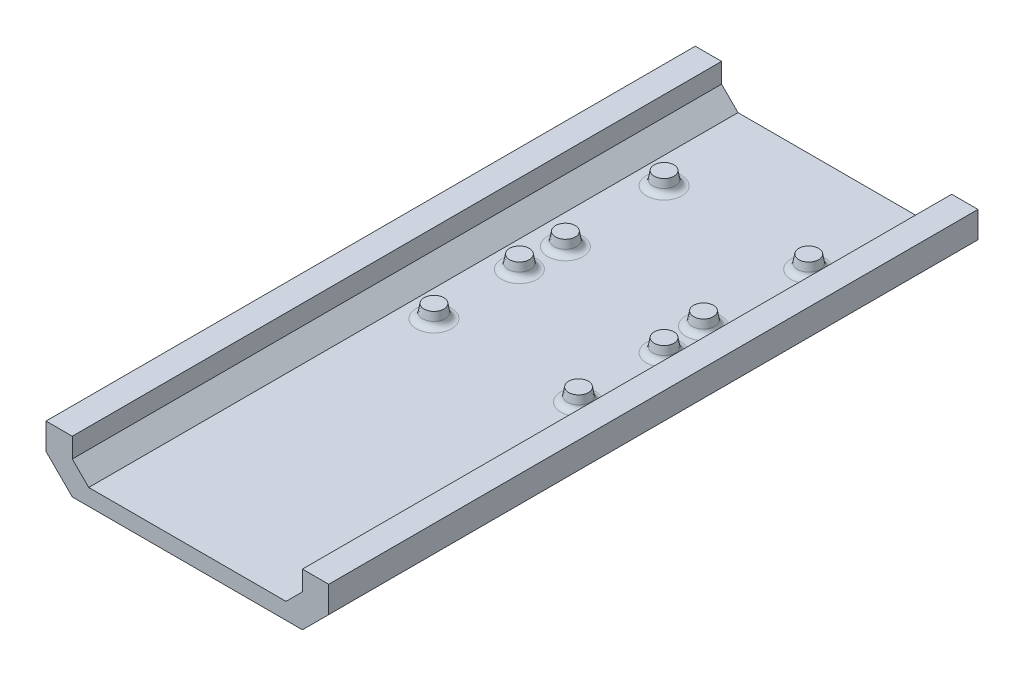
ISO-10303-21;
HEADER;
FILE_DESCRIPTION(('STEP AP214'),'2;1');
FILE_NAME('part.step','',(''),(''),'','','');
FILE_SCHEMA(('AUTOMOTIVE_DESIGN { 1 0 10303 214 1 1 1 1 }'));
ENDSEC;
DATA;
#1=APPLICATION_CONTEXT('core data for automotive mechanical design processes');
#2=APPLICATION_PROTOCOL_DEFINITION('international standard','automotive_design',2000,#1);
#3=PRODUCT_CONTEXT('',#1,'mechanical');
#4=PRODUCT('Part','Part','',(#3));
#5=PRODUCT_RELATED_PRODUCT_CATEGORY('part','',(#4));
#6=PRODUCT_DEFINITION_FORMATION('','',#4);
#7=PRODUCT_DEFINITION_CONTEXT('part definition',#1,'design');
#8=PRODUCT_DEFINITION('design','',#6,#7);
#9=PRODUCT_DEFINITION_SHAPE('','',#8);
#10=(LENGTH_UNIT() NAMED_UNIT(*) SI_UNIT(.MILLI.,.METRE.));
#11=(NAMED_UNIT(*) PLANE_ANGLE_UNIT() SI_UNIT($,.RADIAN.));
#12=(NAMED_UNIT(*) SI_UNIT($,.STERADIAN.) SOLID_ANGLE_UNIT());
#13=UNCERTAINTY_MEASURE_WITH_UNIT(LENGTH_MEASURE(1.E-05),#10,'distance_accuracy_value','');
#14=(GEOMETRIC_REPRESENTATION_CONTEXT(3) GLOBAL_UNCERTAINTY_ASSIGNED_CONTEXT((#13)) GLOBAL_UNIT_ASSIGNED_CONTEXT((#10,
#11,#12)) REPRESENTATION_CONTEXT('',''));
#15=CARTESIAN_POINT('',(0.,0.,0.));
#16=DIRECTION('',(0.,0.,1.));
#17=DIRECTION('',(1.,0.,0.));
#18=AXIS2_PLACEMENT_3D('',#15,#16,#17);
#19=CARTESIAN_POINT('',(-46.0896565672747,-6.55484336424991,-59.4379338238223));
#20=DIRECTION('',(0.,-1.,0.));
#21=DIRECTION('',(0.,0.,-1.));
#22=AXIS2_PLACEMENT_3D('',#19,#20,#21);
#23=CONICAL_SURFACE('',#22,3.81,0.174532925199433);
#24=CARTESIAN_POINT('',(-46.0896565672747,-9.53590973552391,-59.4379338238223));
#25=DIRECTION('',(0.,-1.,0.));
#26=DIRECTION('',(0.,0.,-1.));
#27=AXIS2_PLACEMENT_3D('',#24,#25,#26);
#28=CIRCLE('',#27,4.33564243253829);
#29=CARTESIAN_POINT('',(-46.0896565672747,-9.53590973552391,-63.7735762563605));
#30=VERTEX_POINT('',#29);
#31=EDGE_CURVE('E314',#30,#30,#28,.F.);
#32=ORIENTED_EDGE('',*,*,#31,.T.);
#33=EDGE_LOOP('',(#32));
#34=FACE_BOUND('',#33,.T.);
#35=CARTESIAN_POINT('',(-46.0896565672747,-6.55484336424991,-59.4379338238223));
#36=DIRECTION('',(0.,-1.,0.));
#37=DIRECTION('',(0.,0.,-1.));
#38=AXIS2_PLACEMENT_3D('',#35,#36,#37);
#39=CIRCLE('',#38,3.81);
#40=CARTESIAN_POINT('',(-46.0896565672747,-6.55484336424991,-63.2479338238223));
#41=VERTEX_POINT('',#40);
#42=EDGE_CURVE('E278',#41,#41,#39,.T.);
#43=ORIENTED_EDGE('',*,*,#42,.T.);
#44=EDGE_LOOP('',(#43));
#45=FACE_BOUND('',#44,.T.);
#46=ADVANCED_FACE('F40',(#34,#45),#23,.T.);
#47=CARTESIAN_POINT('',(-46.0896565672747,-6.55484336424991,-3.55793382382226));
#48=DIRECTION('',(0.,-1.,0.));
#49=DIRECTION('',(0.,0.,-1.));
#50=AXIS2_PLACEMENT_3D('',#47,#48,#49);
#51=CONICAL_SURFACE('',#50,3.81,0.174532925199433);
#52=CARTESIAN_POINT('',(-46.0896565672747,-9.53590973552391,-3.55793382382226));
#53=DIRECTION('',(0.,-1.,0.));
#54=DIRECTION('',(0.,0.,-1.));
#55=AXIS2_PLACEMENT_3D('',#52,#53,#54);
#56=CIRCLE('',#55,4.33564243253829);
#57=CARTESIAN_POINT('',(-46.0896565672747,-9.53590973552391,-7.89357625636054));
#58=VERTEX_POINT('',#57);
#59=EDGE_CURVE('E322',#58,#58,#56,.F.);
#60=ORIENTED_EDGE('',*,*,#59,.T.);
#61=EDGE_LOOP('',(#60));
#62=FACE_BOUND('',#61,.T.);
#63=CARTESIAN_POINT('',(-46.0896565672747,-6.55484336424991,-3.55793382382226));
#64=DIRECTION('',(0.,1.,0.));
#65=DIRECTION('',(0.,0.,1.));
#66=AXIS2_PLACEMENT_3D('',#63,#64,#65);
#67=CIRCLE('',#66,3.81);
#68=CARTESIAN_POINT('',(-46.0896565672747,-6.55484336424991,0.25206617617774));
#69=VERTEX_POINT('',#68);
#70=EDGE_CURVE('E520',#69,#69,#67,.T.);
#71=ORIENTED_EDGE('',*,*,#70,.F.);
#72=EDGE_LOOP('',(#71));
#73=FACE_BOUND('',#72,.T.);
#74=ADVANCED_FACE('F358',(#62,#73),#51,.T.);
#75=CARTESIAN_POINT('',(-46.0896565672747,-6.55484336424991,29.4620661761777));
#76=DIRECTION('',(0.,-1.,0.));
#77=DIRECTION('',(0.,0.,-1.));
#78=AXIS2_PLACEMENT_3D('',#75,#76,#77);
#79=CONICAL_SURFACE('',#78,3.81,0.174532925199433);
#80=CARTESIAN_POINT('',(-46.0896565672747,-9.53590973552391,29.4620661761777));
#81=DIRECTION('',(0.,-1.,0.));
#82=DIRECTION('',(0.,0.,-1.));
#83=AXIS2_PLACEMENT_3D('',#80,#81,#82);
#84=CIRCLE('',#83,4.33564243253829);
#85=CARTESIAN_POINT('',(-46.0896565672747,-9.53590973552391,25.1264237436394));
#86=VERTEX_POINT('',#85);
#87=EDGE_CURVE('E326',#86,#86,#84,.F.);
#88=ORIENTED_EDGE('',*,*,#87,.T.);
#89=EDGE_LOOP('',(#88));
#90=FACE_BOUND('',#89,.T.);
#91=CARTESIAN_POINT('',(-46.0896565672747,-6.55484336424991,29.4620661761777));
#92=DIRECTION('',(0.,-1.,0.));
#93=DIRECTION('',(0.,0.,-1.));
#94=AXIS2_PLACEMENT_3D('',#91,#92,#93);
#95=CIRCLE('',#94,3.81);
#96=CARTESIAN_POINT('',(-46.0896565672747,-6.55484336424991,25.6520661761777));
#97=VERTEX_POINT('',#96);
#98=EDGE_CURVE('E274',#97,#97,#95,.T.);
#99=ORIENTED_EDGE('',*,*,#98,.T.);
#100=EDGE_LOOP('',(#99));
#101=FACE_BOUND('',#100,.T.);
#102=ADVANCED_FACE('F364',(#90,#101),#79,.T.);
#103=CARTESIAN_POINT('',(9.79034343272531,-6.55484336424991,29.4620661761777));
#104=DIRECTION('',(0.,-1.,0.));
#105=DIRECTION('',(0.,0.,-1.));
#106=AXIS2_PLACEMENT_3D('',#103,#104,#105);
#107=CONICAL_SURFACE('',#106,3.81,0.174532925199433);
#108=CARTESIAN_POINT('',(9.79034343272531,-9.53590973552391,29.4620661761777));
#109=DIRECTION('',(0.,-1.,0.));
#110=DIRECTION('',(0.,0.,-1.));
#111=AXIS2_PLACEMENT_3D('',#108,#109,#110);
#112=CIRCLE('',#111,4.33564243253829);
#113=CARTESIAN_POINT('',(9.79034343272531,-9.53590973552391,25.1264237436394));
#114=VERTEX_POINT('',#113);
#115=EDGE_CURVE('E330',#114,#114,#112,.F.);
#116=ORIENTED_EDGE('',*,*,#115,.T.);
#117=EDGE_LOOP('',(#116));
#118=FACE_BOUND('',#117,.T.);
#119=CARTESIAN_POINT('',(9.79034343272531,-6.55484336424991,29.4620661761777));
#120=DIRECTION('',(0.,-1.,0.));
#121=DIRECTION('',(0.,0.,-1.));
#122=AXIS2_PLACEMENT_3D('',#119,#120,#121);
#123=CIRCLE('',#122,3.81);
#124=CARTESIAN_POINT('',(9.79034343272531,-6.55484336424991,25.6520661761777));
#125=VERTEX_POINT('',#124);
#126=EDGE_CURVE('E270',#125,#125,#123,.T.);
#127=ORIENTED_EDGE('',*,*,#126,.T.);
#128=EDGE_LOOP('',(#127));
#129=FACE_BOUND('',#128,.T.);
#130=ADVANCED_FACE('F493',(#118,#129),#107,.T.);
#131=CARTESIAN_POINT('',(9.79034343272531,-6.55484336424991,-3.55793382382222));
#132=DIRECTION('',(0.,-1.,0.));
#133=DIRECTION('',(0.,0.,-1.));
#134=AXIS2_PLACEMENT_3D('',#131,#132,#133);
#135=CONICAL_SURFACE('',#134,3.81,0.174532925199433);
#136=CARTESIAN_POINT('',(9.79034343272531,-9.53590973552391,-3.55793382382222));
#137=DIRECTION('',(0.,-1.,0.));
#138=DIRECTION('',(0.,0.,-1.));
#139=AXIS2_PLACEMENT_3D('',#136,#137,#138);
#140=CIRCLE('',#139,4.33564243253829);
#141=CARTESIAN_POINT('',(9.79034343272531,-9.53590973552391,-7.89357625636051));
#142=VERTEX_POINT('',#141);
#143=EDGE_CURVE('E334',#142,#142,#140,.F.);
#144=ORIENTED_EDGE('',*,*,#143,.T.);
#145=EDGE_LOOP('',(#144));
#146=FACE_BOUND('',#145,.T.);
#147=CARTESIAN_POINT('',(9.79034343272531,-6.55484336424991,-3.55793382382222));
#148=DIRECTION('',(0.,1.,0.));
#149=DIRECTION('',(0.,0.,1.));
#150=AXIS2_PLACEMENT_3D('',#147,#148,#149);
#151=CIRCLE('',#150,3.81);
#152=CARTESIAN_POINT('',(9.79034343272531,-6.55484336424991,0.252066176177775));
#153=VERTEX_POINT('',#152);
#154=EDGE_CURVE('E523',#153,#153,#151,.T.);
#155=ORIENTED_EDGE('',*,*,#154,.F.);
#156=EDGE_LOOP('',(#155));
#157=FACE_BOUND('',#156,.T.);
#158=ADVANCED_FACE('F486',(#146,#157),#135,.T.);
#159=CARTESIAN_POINT('',(9.79034343272529,-6.55484336424991,-59.4379338238223));
#160=DIRECTION('',(0.,-1.,0.));
#161=DIRECTION('',(0.,0.,-1.));
#162=AXIS2_PLACEMENT_3D('',#159,#160,#161);
#163=CONICAL_SURFACE('',#162,3.81,0.174532925199433);
#164=CARTESIAN_POINT('',(9.79034343272529,-9.53590973552391,-59.4379338238223));
#165=DIRECTION('',(0.,-1.,0.));
#166=DIRECTION('',(0.,0.,-1.));
#167=AXIS2_PLACEMENT_3D('',#164,#165,#166);
#168=CIRCLE('',#167,4.33564243253829);
#169=CARTESIAN_POINT('',(9.79034343272529,-9.53590973552391,-63.7735762563605));
#170=VERTEX_POINT('',#169);
#171=EDGE_CURVE('E11',#170,#170,#168,.F.);
#172=ORIENTED_EDGE('',*,*,#171,.T.);
#173=EDGE_LOOP('',(#172));
#174=FACE_BOUND('',#173,.T.);
#175=CARTESIAN_POINT('',(9.79034343272529,-6.55484336424991,-59.4379338238223));
#176=DIRECTION('',(0.,-1.,0.));
#177=DIRECTION('',(0.,0.,-1.));
#178=AXIS2_PLACEMENT_3D('',#175,#176,#177);
#179=CIRCLE('',#178,3.81);
#180=CARTESIAN_POINT('',(9.79034343272529,-6.55484336424991,-63.2479338238223));
#181=VERTEX_POINT('',#180);
#182=EDGE_CURVE('E140',#181,#181,#179,.T.);
#183=ORIENTED_EDGE('',*,*,#182,.T.);
#184=EDGE_LOOP('',(#183));
#185=FACE_BOUND('',#184,.T.);
#186=ADVANCED_FACE('F477',(#174,#185),#163,.T.);
#187=CARTESIAN_POINT('',(19.9503434327253,-11.6348433642499,-98.1729338238222));
#188=DIRECTION('',(0.707106781186544,-0.707106781186552,0.));
#189=DIRECTION('',(0.707106781186552,0.707106781186544,0.));
#190=AXIS2_PLACEMENT_3D('',#187,#188,#189);
#191=PLANE('',#190);
#192=DIRECTION('',(0.,0.,1.));
#193=VECTOR('',#192,1.);
#194=CARTESIAN_POINT('',(19.9503434327253,-11.6348433642499,-98.1729338238222));
#195=LINE('',#194,#193);
#196=CARTESIAN_POINT('',(19.9503434327253,-11.6348433642499,-98.1729338238222));
#197=VERTEX_POINT('',#196);
#198=CARTESIAN_POINT('',(19.9503434327253,-11.6348433642499,152.652066176178));
#199=VERTEX_POINT('',#198);
#200=EDGE_CURVE('E156',#197,#199,#195,.T.);
#201=ORIENTED_EDGE('',*,*,#200,.T.);
#202=DIRECTION('',(0.707106781186551,0.707106781186544,0.));
#203=VECTOR('',#202,1.);
#204=CARTESIAN_POINT('',(19.9503434327253,-11.6348433642499,152.652066176178));
#205=LINE('',#204,#203);
#206=CARTESIAN_POINT('',(26.3003434327254,-5.28484336424991,152.652066176178));
#207=VERTEX_POINT('',#206);
#208=EDGE_CURVE('E148',#199,#207,#205,.T.);
#209=ORIENTED_EDGE('',*,*,#208,.T.);
#210=DIRECTION('',(0.,0.,1.));
#211=VECTOR('',#210,1.);
#212=CARTESIAN_POINT('',(26.3003434327254,-5.28484336424991,-98.1729338238222));
#213=LINE('',#212,#211);
#214=CARTESIAN_POINT('',(26.3003434327254,-5.28484336424991,-98.1729338238222));
#215=VERTEX_POINT('',#214);
#216=EDGE_CURVE('E130',#215,#207,#213,.T.);
#217=ORIENTED_EDGE('',*,*,#216,.F.);
#218=DIRECTION('',(0.707106781186551,0.707106781186544,0.));
#219=VECTOR('',#218,1.);
#220=CARTESIAN_POINT('',(19.9503434327253,-11.6348433642499,-98.1729338238222));
#221=LINE('',#220,#219);
#222=EDGE_CURVE('E203',#197,#215,#221,.T.);
#223=ORIENTED_EDGE('',*,*,#222,.F.);
#224=EDGE_LOOP('',(#201,#209,#217,#223));
#225=FACE_BOUND('',#224,.T.);
#226=ADVANCED_FACE('F155',(#225),#191,.F.);
#227=CARTESIAN_POINT('',(26.3003434327254,-5.28484336424991,-98.1729338238222));
#228=DIRECTION('',(1.,0.,0.));
#229=DIRECTION('',(0.,0.,-1.));
#230=AXIS2_PLACEMENT_3D('',#227,#228,#229);
#231=PLANE('',#230);
#232=ORIENTED_EDGE('',*,*,#216,.T.);
#233=DIRECTION('',(0.,1.,0.));
#234=VECTOR('',#233,1.);
#235=CARTESIAN_POINT('',(26.3003434327254,-5.28484336424991,152.652066176178));
#236=LINE('',#235,#234);
#237=CARTESIAN_POINT('',(26.3003434327254,2.33515663575009,152.652066176178));
#238=VERTEX_POINT('',#237);
#239=EDGE_CURVE('E134',#207,#238,#236,.T.);
#240=ORIENTED_EDGE('',*,*,#239,.T.);
#241=DIRECTION('',(0.,0.,1.));
#242=VECTOR('',#241,1.);
#243=CARTESIAN_POINT('',(26.3003434327254,2.33515663575009,-98.1729338238222));
#244=LINE('',#243,#242);
#245=CARTESIAN_POINT('',(26.3003434327254,2.33515663575009,-98.1729338238222));
#246=VERTEX_POINT('',#245);
#247=EDGE_CURVE('E141',#246,#238,#244,.T.);
#248=ORIENTED_EDGE('',*,*,#247,.F.);
#249=DIRECTION('',(0.,1.,0.));
#250=VECTOR('',#249,1.);
#251=CARTESIAN_POINT('',(26.3003434327254,-5.28484336424991,-98.1729338238222));
#252=LINE('',#251,#250);
#253=EDGE_CURVE('E135',#215,#246,#252,.T.);
#254=ORIENTED_EDGE('',*,*,#253,.F.);
#255=EDGE_LOOP('',(#232,#240,#248,#254));
#256=FACE_BOUND('',#255,.T.);
#257=ADVANCED_FACE('F132',(#256),#231,.F.);
#258=CARTESIAN_POINT('',(26.3003434327254,2.33515663575009,-98.1729338238222));
#259=DIRECTION('',(0.,-1.,0.));
#260=DIRECTION('',(1.,0.,0.));
#261=AXIS2_PLACEMENT_3D('',#258,#259,#260);
#262=PLANE('',#261);
#263=ORIENTED_EDGE('',*,*,#247,.T.);
#264=DIRECTION('',(1.,0.,0.));
#265=VECTOR('',#264,1.);
#266=CARTESIAN_POINT('',(26.3003434327254,2.33515663575009,152.652066176178));
#267=LINE('',#266,#265);
#268=CARTESIAN_POINT('',(36.4603434327254,2.33515663575009,152.652066176178));
#269=VERTEX_POINT('',#268);
#270=EDGE_CURVE('E152',#238,#269,#267,.T.);
#271=ORIENTED_EDGE('',*,*,#270,.T.);
#272=DIRECTION('',(0.,0.,1.));
#273=VECTOR('',#272,1.);
#274=CARTESIAN_POINT('',(36.4603434327254,2.33515663575009,-98.1729338238222));
#275=LINE('',#274,#273);
#276=CARTESIAN_POINT('',(36.4603434327254,2.33515663575009,-98.1729338238222));
#277=VERTEX_POINT('',#276);
#278=EDGE_CURVE('E262',#277,#269,#275,.T.);
#279=ORIENTED_EDGE('',*,*,#278,.F.);
#280=DIRECTION('',(1.,0.,0.));
#281=VECTOR('',#280,1.);
#282=CARTESIAN_POINT('',(26.3003434327254,2.33515663575009,-98.1729338238222));
#283=LINE('',#282,#281);
#284=EDGE_CURVE('E208',#246,#277,#283,.T.);
#285=ORIENTED_EDGE('',*,*,#284,.F.);
#286=EDGE_LOOP('',(#263,#271,#279,#285));
#287=FACE_BOUND('',#286,.T.);
#288=ADVANCED_FACE('F446',(#287),#262,.F.);
#289=CARTESIAN_POINT('',(36.4603434327254,2.33515663575009,-98.1729338238222));
#290=DIRECTION('',(-1.,0.,0.));
#291=DIRECTION('',(0.,0.,1.));
#292=AXIS2_PLACEMENT_3D('',#289,#290,#291);
#293=PLANE('',#292);
#294=ORIENTED_EDGE('',*,*,#278,.T.);
#295=DIRECTION('',(0.,-1.,0.));
#296=VECTOR('',#295,1.);
#297=CARTESIAN_POINT('',(36.4603434327254,2.33515663575009,152.652066176178));
#298=LINE('',#297,#296);
#299=CARTESIAN_POINT('',(36.4603434327254,-7.82484336425003,152.652066176178));
#300=VERTEX_POINT('',#299);
#301=EDGE_CURVE('E168',#269,#300,#298,.T.);
#302=ORIENTED_EDGE('',*,*,#301,.T.);
#303=DIRECTION('',(0.,0.,1.));
#304=VECTOR('',#303,1.);
#305=CARTESIAN_POINT('',(36.4603434327254,-7.82484336425003,-98.1729338238222));
#306=LINE('',#305,#304);
#307=CARTESIAN_POINT('',(36.4603434327254,-7.82484336425003,-98.1729338238222));
#308=VERTEX_POINT('',#307);
#309=EDGE_CURVE('E259',#308,#300,#306,.T.);
#310=ORIENTED_EDGE('',*,*,#309,.F.);
#311=DIRECTION('',(0.,-1.,0.));
#312=VECTOR('',#311,1.);
#313=CARTESIAN_POINT('',(36.4603434327254,2.33515663575009,-98.1729338238222));
#314=LINE('',#313,#312);
#315=EDGE_CURVE('E211',#277,#308,#314,.T.);
#316=ORIENTED_EDGE('',*,*,#315,.F.);
#317=EDGE_LOOP('',(#294,#302,#310,#316));
#318=FACE_BOUND('',#317,.T.);
#319=ADVANCED_FACE('F441',(#318),#293,.F.);
#320=CARTESIAN_POINT('',(36.4603434327254,-7.82484336425003,-98.1729338238222));
#321=DIRECTION('',(-0.707106781186543,0.707106781186552,0.));
#322=DIRECTION('',(-0.707106781186552,-0.707106781186543,0.));
#323=AXIS2_PLACEMENT_3D('',#320,#321,#322);
#324=PLANE('',#323);
#325=ORIENTED_EDGE('',*,*,#309,.T.);
#326=DIRECTION('',(-0.707106781186552,-0.707106781186544,0.));
#327=VECTOR('',#326,1.);
#328=CARTESIAN_POINT('',(36.4603434327254,-7.82484336425003,152.652066176178));
#329=LINE('',#328,#327);
#330=CARTESIAN_POINT('',(26.3003434327254,-17.9848433642499,152.652066176178));
#331=VERTEX_POINT('',#330);
#332=EDGE_CURVE('E172',#300,#331,#329,.T.);
#333=ORIENTED_EDGE('',*,*,#332,.T.);
#334=DIRECTION('',(0.,0.,1.));
#335=VECTOR('',#334,1.);
#336=CARTESIAN_POINT('',(26.3003434327254,-17.9848433642499,-98.1729338238222));
#337=LINE('',#336,#335);
#338=CARTESIAN_POINT('',(26.3003434327254,-17.9848433642499,-98.1729338238222));
#339=VERTEX_POINT('',#338);
#340=EDGE_CURVE('E256',#339,#331,#337,.T.);
#341=ORIENTED_EDGE('',*,*,#340,.F.);
#342=DIRECTION('',(-0.707106781186552,-0.707106781186544,0.));
#343=VECTOR('',#342,1.);
#344=CARTESIAN_POINT('',(36.4603434327254,-7.82484336425003,-98.1729338238222));
#345=LINE('',#344,#343);
#346=EDGE_CURVE('E214',#308,#339,#345,.T.);
#347=ORIENTED_EDGE('',*,*,#346,.F.);
#348=EDGE_LOOP('',(#325,#333,#341,#347));
#349=FACE_BOUND('',#348,.T.);
#350=ADVANCED_FACE('F438',(#349),#324,.F.);
#351=CARTESIAN_POINT('',(26.3003434327254,-17.9848433642499,-98.1729338238222));
#352=DIRECTION('',(0.,1.,0.));
#353=DIRECTION('',(0.,0.,1.));
#354=AXIS2_PLACEMENT_3D('',#351,#352,#353);
#355=PLANE('',#354);
#356=ORIENTED_EDGE('',*,*,#340,.T.);
#357=DIRECTION('',(-1.,0.,0.));
#358=VECTOR('',#357,1.);
#359=CARTESIAN_POINT('',(26.3003434327254,-17.9848433642499,152.652066176178));
#360=LINE('',#359,#358);
#361=CARTESIAN_POINT('',(-62.5996565672748,-17.9848433642499,152.652066176178));
#362=VERTEX_POINT('',#361);
#363=EDGE_CURVE('E176',#331,#362,#360,.T.);
#364=ORIENTED_EDGE('',*,*,#363,.T.);
#365=DIRECTION('',(0.,0.,1.));
#366=VECTOR('',#365,1.);
#367=CARTESIAN_POINT('',(-62.5996565672748,-17.9848433642499,-98.1729338238222));
#368=LINE('',#367,#366);
#369=CARTESIAN_POINT('',(-62.5996565672748,-17.9848433642499,-98.1729338238222));
#370=VERTEX_POINT('',#369);
#371=EDGE_CURVE('E253',#370,#362,#368,.T.);
#372=ORIENTED_EDGE('',*,*,#371,.F.);
#373=DIRECTION('',(-1.,0.,0.));
#374=VECTOR('',#373,1.);
#375=CARTESIAN_POINT('',(26.3003434327254,-17.9848433642499,-98.1729338238222));
#376=LINE('',#375,#374);
#377=EDGE_CURVE('E217',#339,#370,#376,.T.);
#378=ORIENTED_EDGE('',*,*,#377,.F.);
#379=EDGE_LOOP('',(#356,#364,#372,#378));
#380=FACE_BOUND('',#379,.T.);
#381=ADVANCED_FACE('F433',(#380),#355,.F.);
#382=CARTESIAN_POINT('',(-72.7596565672748,-7.82484336425003,-98.1729338238222));
#383=DIRECTION('',(0.707106781186543,0.707106781186552,0.));
#384=DIRECTION('',(-0.707106781186552,0.707106781186543,0.));
#385=AXIS2_PLACEMENT_3D('',#382,#383,#384);
#386=PLANE('',#385);
#387=ORIENTED_EDGE('',*,*,#371,.T.);
#388=DIRECTION('',(-0.707106781186552,0.707106781186543,0.));
#389=VECTOR('',#388,1.);
#390=CARTESIAN_POINT('',(-72.7596565672748,-7.82484336425003,152.652066176178));
#391=LINE('',#390,#389);
#392=CARTESIAN_POINT('',(-72.7596565672748,-7.82484336425003,152.652066176178));
#393=VERTEX_POINT('',#392);
#394=EDGE_CURVE('E180',#362,#393,#391,.T.);
#395=ORIENTED_EDGE('',*,*,#394,.T.);
#396=DIRECTION('',(0.,0.,1.));
#397=VECTOR('',#396,1.);
#398=CARTESIAN_POINT('',(-72.7596565672748,-7.82484336425003,-98.1729338238222));
#399=LINE('',#398,#397);
#400=CARTESIAN_POINT('',(-72.7596565672748,-7.82484336425003,-98.1729338238222));
#401=VERTEX_POINT('',#400);
#402=EDGE_CURVE('E250',#401,#393,#399,.T.);
#403=ORIENTED_EDGE('',*,*,#402,.F.);
#404=DIRECTION('',(-0.707106781186552,0.707106781186543,0.));
#405=VECTOR('',#404,1.);
#406=CARTESIAN_POINT('',(-72.7596565672748,-7.82484336425003,-98.1729338238222));
#407=LINE('',#406,#405);
#408=EDGE_CURVE('E220',#370,#401,#407,.T.);
#409=ORIENTED_EDGE('',*,*,#408,.F.);
#410=EDGE_LOOP('',(#387,#395,#403,#409));
#411=FACE_BOUND('',#410,.T.);
#412=ADVANCED_FACE('F428',(#411),#386,.F.);
#413=CARTESIAN_POINT('',(-72.7596565672748,2.33515663575009,-98.1729338238222));
#414=DIRECTION('',(1.,0.,0.));
#415=DIRECTION('',(0.,0.,-1.));
#416=AXIS2_PLACEMENT_3D('',#413,#414,#415);
#417=PLANE('',#416);
#418=ORIENTED_EDGE('',*,*,#402,.T.);
#419=DIRECTION('',(0.,1.,0.));
#420=VECTOR('',#419,1.);
#421=CARTESIAN_POINT('',(-72.7596565672748,2.33515663575009,152.652066176178));
#422=LINE('',#421,#420);
#423=CARTESIAN_POINT('',(-72.7596565672748,2.33515663575009,152.652066176178));
#424=VERTEX_POINT('',#423);
#425=EDGE_CURVE('E184',#393,#424,#422,.T.);
#426=ORIENTED_EDGE('',*,*,#425,.T.);
#427=DIRECTION('',(0.,0.,1.));
#428=VECTOR('',#427,1.);
#429=CARTESIAN_POINT('',(-72.7596565672748,2.33515663575009,-98.1729338238222));
#430=LINE('',#429,#428);
#431=CARTESIAN_POINT('',(-72.7596565672748,2.33515663575009,-98.1729338238222));
#432=VERTEX_POINT('',#431);
#433=EDGE_CURVE('E247',#432,#424,#430,.T.);
#434=ORIENTED_EDGE('',*,*,#433,.F.);
#435=DIRECTION('',(0.,1.,0.));
#436=VECTOR('',#435,1.);
#437=CARTESIAN_POINT('',(-72.7596565672748,2.33515663575009,-98.1729338238222));
#438=LINE('',#437,#436);
#439=EDGE_CURVE('E223',#401,#432,#438,.T.);
#440=ORIENTED_EDGE('',*,*,#439,.F.);
#441=EDGE_LOOP('',(#418,#426,#434,#440));
#442=FACE_BOUND('',#441,.T.);
#443=ADVANCED_FACE('F423',(#442),#417,.F.);
#444=CARTESIAN_POINT('',(-62.5996565672748,2.33515663575009,-98.1729338238222));
#445=DIRECTION('',(0.,-1.,0.));
#446=DIRECTION('',(1.,0.,0.));
#447=AXIS2_PLACEMENT_3D('',#444,#445,#446);
#448=PLANE('',#447);
#449=ORIENTED_EDGE('',*,*,#433,.T.);
#450=DIRECTION('',(1.,0.,0.));
#451=VECTOR('',#450,1.);
#452=CARTESIAN_POINT('',(-62.5996565672748,2.33515663575009,152.652066176178));
#453=LINE('',#452,#451);
#454=CARTESIAN_POINT('',(-62.5996565672748,2.33515663575009,152.652066176178));
#455=VERTEX_POINT('',#454);
#456=EDGE_CURVE('E188',#424,#455,#453,.T.);
#457=ORIENTED_EDGE('',*,*,#456,.T.);
#458=DIRECTION('',(0.,0.,1.));
#459=VECTOR('',#458,1.);
#460=CARTESIAN_POINT('',(-62.5996565672748,2.33515663575009,-98.1729338238222));
#461=LINE('',#460,#459);
#462=CARTESIAN_POINT('',(-62.5996565672748,2.33515663575009,-98.1729338238222));
#463=VERTEX_POINT('',#462);
#464=EDGE_CURVE('E244',#463,#455,#461,.T.);
#465=ORIENTED_EDGE('',*,*,#464,.F.);
#466=DIRECTION('',(1.,0.,0.));
#467=VECTOR('',#466,1.);
#468=CARTESIAN_POINT('',(-62.5996565672748,2.33515663575009,-98.1729338238222));
#469=LINE('',#468,#467);
#470=EDGE_CURVE('E226',#432,#463,#469,.T.);
#471=ORIENTED_EDGE('',*,*,#470,.F.);
#472=EDGE_LOOP('',(#449,#457,#465,#471));
#473=FACE_BOUND('',#472,.T.);
#474=ADVANCED_FACE('F418',(#473),#448,.F.);
#475=CARTESIAN_POINT('',(-62.5996565672748,-5.28484336424991,-98.1729338238222));
#476=DIRECTION('',(-1.,0.,0.));
#477=DIRECTION('',(0.,0.,1.));
#478=AXIS2_PLACEMENT_3D('',#475,#476,#477);
#479=PLANE('',#478);
#480=ORIENTED_EDGE('',*,*,#464,.T.);
#481=DIRECTION('',(0.,-1.,0.));
#482=VECTOR('',#481,1.);
#483=CARTESIAN_POINT('',(-62.5996565672748,-5.28484336424991,152.652066176178));
#484=LINE('',#483,#482);
#485=CARTESIAN_POINT('',(-62.5996565672748,-5.28484336424991,152.652066176178));
#486=VERTEX_POINT('',#485);
#487=EDGE_CURVE('E192',#455,#486,#484,.T.);
#488=ORIENTED_EDGE('',*,*,#487,.T.);
#489=DIRECTION('',(0.,0.,1.));
#490=VECTOR('',#489,1.);
#491=CARTESIAN_POINT('',(-62.5996565672748,-5.28484336424991,-98.1729338238222));
#492=LINE('',#491,#490);
#493=CARTESIAN_POINT('',(-62.5996565672748,-5.28484336424991,-98.1729338238222));
#494=VERTEX_POINT('',#493);
#495=EDGE_CURVE('E241',#494,#486,#492,.T.);
#496=ORIENTED_EDGE('',*,*,#495,.F.);
#497=DIRECTION('',(0.,-1.,0.));
#498=VECTOR('',#497,1.);
#499=CARTESIAN_POINT('',(-62.5996565672748,-5.28484336424991,-98.1729338238222));
#500=LINE('',#499,#498);
#501=EDGE_CURVE('E229',#463,#494,#500,.T.);
#502=ORIENTED_EDGE('',*,*,#501,.F.);
#503=EDGE_LOOP('',(#480,#488,#496,#502));
#504=FACE_BOUND('',#503,.T.);
#505=ADVANCED_FACE('F413',(#504),#479,.F.);
#506=CARTESIAN_POINT('',(-56.2496565672747,-11.6348433642499,-98.1729338238222));
#507=DIRECTION('',(-0.707106781186543,-0.707106781186552,0.));
#508=DIRECTION('',(0.707106781186552,-0.707106781186543,0.));
#509=AXIS2_PLACEMENT_3D('',#506,#507,#508);
#510=PLANE('',#509);
#511=ORIENTED_EDGE('',*,*,#495,.T.);
#512=DIRECTION('',(0.707106781186552,-0.707106781186544,0.));
#513=VECTOR('',#512,1.);
#514=CARTESIAN_POINT('',(-56.2496565672747,-11.6348433642499,152.652066176178));
#515=LINE('',#514,#513);
#516=CARTESIAN_POINT('',(-56.2496565672747,-11.6348433642499,152.652066176178));
#517=VERTEX_POINT('',#516);
#518=EDGE_CURVE('E196',#486,#517,#515,.T.);
#519=ORIENTED_EDGE('',*,*,#518,.T.);
#520=DIRECTION('',(0.,0.,1.));
#521=VECTOR('',#520,1.);
#522=CARTESIAN_POINT('',(-56.2496565672747,-11.6348433642499,-98.1729338238222));
#523=LINE('',#522,#521);
#524=CARTESIAN_POINT('',(-56.2496565672747,-11.6348433642499,-98.1729338238222));
#525=VERTEX_POINT('',#524);
#526=EDGE_CURVE('E238',#525,#517,#523,.T.);
#527=ORIENTED_EDGE('',*,*,#526,.F.);
#528=DIRECTION('',(0.707106781186552,-0.707106781186544,0.));
#529=VECTOR('',#528,1.);
#530=CARTESIAN_POINT('',(-56.2496565672747,-11.6348433642499,-98.1729338238222));
#531=LINE('',#530,#529);
#532=EDGE_CURVE('E61',#494,#525,#531,.T.);
#533=ORIENTED_EDGE('',*,*,#532,.F.);
#534=EDGE_LOOP('',(#511,#519,#527,#533));
#535=FACE_BOUND('',#534,.T.);
#536=ADVANCED_FACE('F399',(#535),#510,.F.);
#537=CARTESIAN_POINT('',(19.9503434327253,-11.6348433642499,-98.1729338238222));
#538=DIRECTION('',(0.,-1.,0.));
#539=DIRECTION('',(1.,0.,0.));
#540=AXIS2_PLACEMENT_3D('',#537,#538,#539);
#541=PLANE('',#540);
#542=CARTESIAN_POINT('',(-46.0896565672747,-11.6348433642499,-59.4379338238223));
#543=DIRECTION('',(0.,-1.,0.));
#544=DIRECTION('',(1.,0.,0.));
#545=AXIS2_PLACEMENT_3D('',#542,#543,#544);
#546=CIRCLE('',#545,6.83705412518929);
#547=CARTESIAN_POINT('',(-39.2526024420854,-11.6348433642499,-59.4379338238223));
#548=VERTEX_POINT('',#547);
#549=EDGE_CURVE('E310',#548,#548,#546,.T.);
#550=ORIENTED_EDGE('',*,*,#549,.T.);
#551=EDGE_LOOP('',(#550));
#552=FACE_BOUND('',#551,.T.);
#553=CARTESIAN_POINT('',(-44.8196565672747,-11.6348433642499,-20.0679338238223));
#554=DIRECTION('',(0.,-1.,0.));
#555=DIRECTION('',(1.,0.,0.));
#556=AXIS2_PLACEMENT_3D('',#553,#554,#555);
#557=CIRCLE('',#556,6.83705412518929);
#558=CARTESIAN_POINT('',(-37.9826024420854,-11.6348433642499,-20.0679338238223));
#559=VERTEX_POINT('',#558);
#560=EDGE_CURVE('E306',#559,#559,#557,.T.);
#561=ORIENTED_EDGE('',*,*,#560,.T.);
#562=EDGE_LOOP('',(#561));
#563=FACE_BOUND('',#562,.T.);
#564=CARTESIAN_POINT('',(-46.0896565672747,-11.6348433642499,-3.55793382382226));
#565=DIRECTION('',(0.,-1.,0.));
#566=DIRECTION('',(1.,0.,0.));
#567=AXIS2_PLACEMENT_3D('',#564,#565,#566);
#568=CIRCLE('',#567,6.83705412518929);
#569=CARTESIAN_POINT('',(-39.2526024420854,-11.6348433642499,-3.55793382382226));
#570=VERTEX_POINT('',#569);
#571=EDGE_CURVE('E302',#570,#570,#568,.T.);
#572=ORIENTED_EDGE('',*,*,#571,.T.);
#573=EDGE_LOOP('',(#572));
#574=FACE_BOUND('',#573,.T.);
#575=CARTESIAN_POINT('',(-46.0896565672747,-11.6348433642499,29.4620661761777));
#576=DIRECTION('',(0.,-1.,0.));
#577=DIRECTION('',(1.,0.,0.));
#578=AXIS2_PLACEMENT_3D('',#575,#576,#577);
#579=CIRCLE('',#578,6.83705412518929);
#580=CARTESIAN_POINT('',(-39.2526024420854,-11.6348433642499,29.4620661761777));
#581=VERTEX_POINT('',#580);
#582=EDGE_CURVE('E298',#581,#581,#579,.T.);
#583=ORIENTED_EDGE('',*,*,#582,.T.);
#584=EDGE_LOOP('',(#583));
#585=FACE_BOUND('',#584,.T.);
#586=CARTESIAN_POINT('',(9.79034343272531,-11.6348433642499,29.4620661761777));
#587=DIRECTION('',(0.,-1.,0.));
#588=DIRECTION('',(1.,0.,0.));
#589=AXIS2_PLACEMENT_3D('',#586,#587,#588);
#590=CIRCLE('',#589,6.83705412518929);
#591=CARTESIAN_POINT('',(16.6273975579146,-11.6348433642499,29.4620661761777));
#592=VERTEX_POINT('',#591);
#593=EDGE_CURVE('E294',#592,#592,#590,.T.);
#594=ORIENTED_EDGE('',*,*,#593,.T.);
#595=EDGE_LOOP('',(#594));
#596=FACE_BOUND('',#595,.T.);
#597=CARTESIAN_POINT('',(9.79034343272531,-11.6348433642499,-3.55793382382222));
#598=DIRECTION('',(0.,-1.,0.));
#599=DIRECTION('',(1.,0.,0.));
#600=AXIS2_PLACEMENT_3D('',#597,#598,#599);
#601=CIRCLE('',#600,6.83705412518929);
#602=CARTESIAN_POINT('',(16.6273975579146,-11.6348433642499,-3.55793382382222));
#603=VERTEX_POINT('',#602);
#604=EDGE_CURVE('E290',#603,#603,#601,.T.);
#605=ORIENTED_EDGE('',*,*,#604,.T.);
#606=EDGE_LOOP('',(#605));
#607=FACE_BOUND('',#606,.T.);
#608=CARTESIAN_POINT('',(8.52034343272528,-11.6348433642499,-20.0679338238223));
#609=DIRECTION('',(0.,-1.,0.));
#610=DIRECTION('',(1.,0.,0.));
#611=AXIS2_PLACEMENT_3D('',#608,#609,#610);
#612=CIRCLE('',#611,6.83705412518929);
#613=CARTESIAN_POINT('',(15.3573975579146,-11.6348433642499,-20.0679338238223));
#614=VERTEX_POINT('',#613);
#615=EDGE_CURVE('E286',#614,#614,#612,.T.);
#616=ORIENTED_EDGE('',*,*,#615,.T.);
#617=EDGE_LOOP('',(#616));
#618=FACE_BOUND('',#617,.T.);
#619=CARTESIAN_POINT('',(9.79034343272529,-11.6348433642499,-59.4379338238223));
#620=DIRECTION('',(0.,-1.,0.));
#621=DIRECTION('',(1.,0.,0.));
#622=AXIS2_PLACEMENT_3D('',#619,#620,#621);
#623=CIRCLE('',#622,6.83705412518929);
#624=CARTESIAN_POINT('',(16.6273975579146,-11.6348433642499,-59.4379338238223));
#625=VERTEX_POINT('',#624);
#626=EDGE_CURVE('E282',#625,#625,#623,.T.);
#627=ORIENTED_EDGE('',*,*,#626,.T.);
#628=EDGE_LOOP('',(#627));
#629=FACE_BOUND('',#628,.T.);
#630=ORIENTED_EDGE('',*,*,#526,.T.);
#631=DIRECTION('',(1.,0.,0.));
#632=VECTOR('',#631,1.);
#633=CARTESIAN_POINT('',(19.9503434327253,-11.6348433642499,152.652066176178));
#634=LINE('',#633,#632);
#635=EDGE_CURVE('E200',#517,#199,#634,.T.);
#636=ORIENTED_EDGE('',*,*,#635,.T.);
#637=ORIENTED_EDGE('',*,*,#200,.F.);
#638=DIRECTION('',(1.,0.,0.));
#639=VECTOR('',#638,1.);
#640=CARTESIAN_POINT('',(19.9503434327253,-11.6348433642499,-98.1729338238222));
#641=LINE('',#640,#639);
#642=EDGE_CURVE('E56',#525,#197,#641,.T.);
#643=ORIENTED_EDGE('',*,*,#642,.F.);
#644=EDGE_LOOP('',(#630,#636,#637,#643));
#645=FACE_BOUND('',#644,.T.);
#646=ADVANCED_FACE('F395',(#552,#563,#574,#585,#596,#607,#618,#629,#645),#541,.F.);
#647=CARTESIAN_POINT('',(0.,0.,-98.1729338238222));
#648=DIRECTION('',(0.,0.,-1.));
#649=DIRECTION('',(-1.,0.,0.));
#650=AXIS2_PLACEMENT_3D('',#647,#648,#649);
#651=PLANE('',#650);
#652=ORIENTED_EDGE('',*,*,#222,.T.);
#653=ORIENTED_EDGE('',*,*,#253,.T.);
#654=ORIENTED_EDGE('',*,*,#284,.T.);
#655=ORIENTED_EDGE('',*,*,#315,.T.);
#656=ORIENTED_EDGE('',*,*,#346,.T.);
#657=ORIENTED_EDGE('',*,*,#377,.T.);
#658=ORIENTED_EDGE('',*,*,#408,.T.);
#659=ORIENTED_EDGE('',*,*,#439,.T.);
#660=ORIENTED_EDGE('',*,*,#470,.T.);
#661=ORIENTED_EDGE('',*,*,#501,.T.);
#662=ORIENTED_EDGE('',*,*,#532,.T.);
#663=ORIENTED_EDGE('',*,*,#642,.T.);
#664=EDGE_LOOP('',(#652,#653,#654,#655,#656,#657,#658,#659,#660,#661,#662,#663));
#665=FACE_BOUND('',#664,.T.);
#666=ADVANCED_FACE('F398',(#665),#651,.T.);
#667=CARTESIAN_POINT('',(0.,0.,152.652066176178));
#668=DIRECTION('',(0.,0.,-1.));
#669=DIRECTION('',(-1.,0.,0.));
#670=AXIS2_PLACEMENT_3D('',#667,#668,#669);
#671=PLANE('',#670);
#672=ORIENTED_EDGE('',*,*,#208,.F.);
#673=ORIENTED_EDGE('',*,*,#635,.F.);
#674=ORIENTED_EDGE('',*,*,#518,.F.);
#675=ORIENTED_EDGE('',*,*,#487,.F.);
#676=ORIENTED_EDGE('',*,*,#456,.F.);
#677=ORIENTED_EDGE('',*,*,#425,.F.);
#678=ORIENTED_EDGE('',*,*,#394,.F.);
#679=ORIENTED_EDGE('',*,*,#363,.F.);
#680=ORIENTED_EDGE('',*,*,#332,.F.);
#681=ORIENTED_EDGE('',*,*,#301,.F.);
#682=ORIENTED_EDGE('',*,*,#270,.F.);
#683=ORIENTED_EDGE('',*,*,#239,.F.);
#684=EDGE_LOOP('',(#672,#673,#674,#675,#676,#677,#678,#679,#680,#681,#682,#683));
#685=FACE_BOUND('',#684,.T.);
#686=ADVANCED_FACE('F146',(#685),#671,.F.);
#687=CARTESIAN_POINT('',(8.52034343272528,-6.55484336424991,-20.0679338238223));
#688=DIRECTION('',(0.,-1.,0.));
#689=DIRECTION('',(0.,0.,-1.));
#690=AXIS2_PLACEMENT_3D('',#687,#688,#689);
#691=CONICAL_SURFACE('',#690,3.81,0.174532925199433);
#692=CARTESIAN_POINT('',(8.52034343272528,-9.53590973552391,-20.0679338238223));
#693=DIRECTION('',(0.,-1.,0.));
#694=DIRECTION('',(0.,0.,-1.));
#695=AXIS2_PLACEMENT_3D('',#692,#693,#694);
#696=CIRCLE('',#695,4.33564243253829);
#697=CARTESIAN_POINT('',(8.52034343272528,-9.53590973552391,-24.4035762563605));
#698=VERTEX_POINT('',#697);
#699=EDGE_CURVE('E49',#698,#698,#696,.F.);
#700=ORIENTED_EDGE('',*,*,#699,.T.);
#701=EDGE_LOOP('',(#700));
#702=FACE_BOUND('',#701,.T.);
#703=CARTESIAN_POINT('',(8.52034343272528,-6.55484336424991,-20.0679338238223));
#704=DIRECTION('',(0.,-1.,0.));
#705=DIRECTION('',(0.,0.,-1.));
#706=AXIS2_PLACEMENT_3D('',#703,#704,#705);
#707=CIRCLE('',#706,3.81);
#708=CARTESIAN_POINT('',(8.52034343272528,-6.55484336424991,-23.8779338238223));
#709=VERTEX_POINT('',#708);
#710=EDGE_CURVE('E158',#709,#709,#707,.T.);
#711=ORIENTED_EDGE('',*,*,#710,.T.);
#712=EDGE_LOOP('',(#711));
#713=FACE_BOUND('',#712,.T.);
#714=ADVANCED_FACE('F341',(#702,#713),#691,.T.);
#715=CARTESIAN_POINT('',(8.52034343272528,-6.55484336424991,-20.0679338238223));
#716=DIRECTION('',(0.,-1.,0.));
#717=DIRECTION('',(0.,0.,-1.));
#718=AXIS2_PLACEMENT_3D('',#715,#716,#717);
#719=PLANE('',#718);
#720=ORIENTED_EDGE('',*,*,#710,.F.);
#721=EDGE_LOOP('',(#720));
#722=FACE_BOUND('',#721,.T.);
#723=ADVANCED_FACE('F535',(#722),#719,.F.);
#724=CARTESIAN_POINT('',(-44.8196565672747,-6.55484336424991,-20.0679338238223));
#725=DIRECTION('',(0.,-1.,0.));
#726=DIRECTION('',(0.,0.,-1.));
#727=AXIS2_PLACEMENT_3D('',#724,#725,#726);
#728=CONICAL_SURFACE('',#727,3.81,0.174532925199433);
#729=CARTESIAN_POINT('',(-44.8196565672747,-9.53590973552391,-20.0679338238223));
#730=DIRECTION('',(0.,-1.,0.));
#731=DIRECTION('',(0.,0.,-1.));
#732=AXIS2_PLACEMENT_3D('',#729,#730,#731);
#733=CIRCLE('',#732,4.33564243253829);
#734=CARTESIAN_POINT('',(-44.8196565672747,-9.53590973552391,-24.4035762563605));
#735=VERTEX_POINT('',#734);
#736=EDGE_CURVE('E318',#735,#735,#733,.F.);
#737=ORIENTED_EDGE('',*,*,#736,.T.);
#738=EDGE_LOOP('',(#737));
#739=FACE_BOUND('',#738,.T.);
#740=CARTESIAN_POINT('',(-44.8196565672747,-6.55484336424991,-20.0679338238223));
#741=DIRECTION('',(0.,-1.,0.));
#742=DIRECTION('',(0.,0.,-1.));
#743=AXIS2_PLACEMENT_3D('',#740,#741,#742);
#744=CIRCLE('',#743,3.81);
#745=CARTESIAN_POINT('',(-44.8196565672747,-6.55484336424991,-23.8779338238223));
#746=VERTEX_POINT('',#745);
#747=EDGE_CURVE('E162',#746,#746,#744,.T.);
#748=ORIENTED_EDGE('',*,*,#747,.T.);
#749=EDGE_LOOP('',(#748));
#750=FACE_BOUND('',#749,.T.);
#751=ADVANCED_FACE('F515',(#739,#750),#728,.T.);
#752=CARTESIAN_POINT('',(-44.8196565672747,-6.55484336424991,-20.0679338238223));
#753=DIRECTION('',(0.,-1.,0.));
#754=DIRECTION('',(0.,0.,-1.));
#755=AXIS2_PLACEMENT_3D('',#752,#753,#754);
#756=PLANE('',#755);
#757=ORIENTED_EDGE('',*,*,#747,.F.);
#758=EDGE_LOOP('',(#757));
#759=FACE_BOUND('',#758,.T.);
#760=ADVANCED_FACE('F510',(#759),#756,.F.);
#761=CARTESIAN_POINT('',(-46.0896565672747,-6.55484336424991,-3.55793382382226));
#762=DIRECTION('',(0.,-1.,0.));
#763=DIRECTION('',(0.,0.,-1.));
#764=AXIS2_PLACEMENT_3D('',#761,#762,#763);
#765=PLANE('',#764);
#766=ORIENTED_EDGE('',*,*,#70,.T.);
#767=EDGE_LOOP('',(#766));
#768=FACE_BOUND('',#767,.T.);
#769=ADVANCED_FACE('F498',(#768),#765,.F.);
#770=CARTESIAN_POINT('',(9.79034343272531,-6.55484336424991,29.4620661761777));
#771=DIRECTION('',(0.,-1.,0.));
#772=DIRECTION('',(0.,0.,-1.));
#773=AXIS2_PLACEMENT_3D('',#770,#771,#772);
#774=PLANE('',#773);
#775=ORIENTED_EDGE('',*,*,#126,.F.);
#776=EDGE_LOOP('',(#775));
#777=FACE_BOUND('',#776,.T.);
#778=ADVANCED_FACE('F495',(#777),#774,.F.);
#779=CARTESIAN_POINT('',(-46.0896565672747,-6.55484336424991,29.4620661761777));
#780=DIRECTION('',(0.,-1.,0.));
#781=DIRECTION('',(0.,0.,-1.));
#782=AXIS2_PLACEMENT_3D('',#779,#780,#781);
#783=PLANE('',#782);
#784=ORIENTED_EDGE('',*,*,#98,.F.);
#785=EDGE_LOOP('',(#784));
#786=FACE_BOUND('',#785,.T.);
#787=ADVANCED_FACE('F482',(#786),#783,.F.);
#788=CARTESIAN_POINT('',(9.79034343272529,-6.55484336424991,-59.4379338238223));
#789=DIRECTION('',(0.,-1.,0.));
#790=DIRECTION('',(0.,0.,-1.));
#791=AXIS2_PLACEMENT_3D('',#788,#789,#790);
#792=PLANE('',#791);
#793=ORIENTED_EDGE('',*,*,#182,.F.);
#794=EDGE_LOOP('',(#793));
#795=FACE_BOUND('',#794,.T.);
#796=ADVANCED_FACE('F478',(#795),#792,.F.);
#797=CARTESIAN_POINT('',(9.79034343272531,-6.55484336424991,-3.55793382382222));
#798=DIRECTION('',(0.,-1.,0.));
#799=DIRECTION('',(0.,0.,-1.));
#800=AXIS2_PLACEMENT_3D('',#797,#798,#799);
#801=PLANE('',#800);
#802=ORIENTED_EDGE('',*,*,#154,.T.);
#803=EDGE_LOOP('',(#802));
#804=FACE_BOUND('',#803,.T.);
#805=ADVANCED_FACE('F481',(#804),#801,.F.);
#806=CARTESIAN_POINT('',(-46.0896565672747,-6.55484336424991,-59.4379338238223));
#807=DIRECTION('',(0.,-1.,0.));
#808=DIRECTION('',(0.,0.,-1.));
#809=AXIS2_PLACEMENT_3D('',#806,#807,#808);
#810=PLANE('',#809);
#811=ORIENTED_EDGE('',*,*,#42,.F.);
#812=EDGE_LOOP('',(#811));
#813=FACE_BOUND('',#812,.T.);
#814=ADVANCED_FACE('F370',(#813),#810,.F.);
#815=CARTESIAN_POINT('',(-46.0896565672747,-9.0948433642499,-59.4379338238223));
#816=DIRECTION('',(0.,-1.,0.));
#817=DIRECTION('',(1.,0.,0.));
#818=AXIS2_PLACEMENT_3D('',#815,#816,#817);
#819=TOROIDAL_SURFACE('',#818,6.83705412518929,2.54);
#820=ORIENTED_EDGE('',*,*,#31,.F.);
#821=EDGE_LOOP('',(#820));
#822=FACE_BOUND('',#821,.T.);
#823=ORIENTED_EDGE('',*,*,#549,.F.);
#824=EDGE_LOOP('',(#823));
#825=FACE_BOUND('',#824,.T.);
#826=ADVANCED_FACE('F371',(#822,#825),#819,.F.);
#827=CARTESIAN_POINT('',(-44.8196565672747,-9.0948433642499,-20.0679338238223));
#828=DIRECTION('',(0.,-1.,0.));
#829=DIRECTION('',(1.,0.,0.));
#830=AXIS2_PLACEMENT_3D('',#827,#828,#829);
#831=TOROIDAL_SURFACE('',#830,6.83705412518929,2.54);
#832=ORIENTED_EDGE('',*,*,#560,.F.);
#833=EDGE_LOOP('',(#832));
#834=FACE_BOUND('',#833,.T.);
#835=ORIENTED_EDGE('',*,*,#736,.F.);
#836=EDGE_LOOP('',(#835));
#837=FACE_BOUND('',#836,.T.);
#838=ADVANCED_FACE('F374',(#834,#837),#831,.F.);
#839=CARTESIAN_POINT('',(-46.0896565672747,-9.0948433642499,-3.55793382382226));
#840=DIRECTION('',(0.,-1.,0.));
#841=DIRECTION('',(1.,0.,0.));
#842=AXIS2_PLACEMENT_3D('',#839,#840,#841);
#843=TOROIDAL_SURFACE('',#842,6.83705412518929,2.54);
#844=ORIENTED_EDGE('',*,*,#59,.F.);
#845=EDGE_LOOP('',(#844));
#846=FACE_BOUND('',#845,.T.);
#847=ORIENTED_EDGE('',*,*,#571,.F.);
#848=EDGE_LOOP('',(#847));
#849=FACE_BOUND('',#848,.T.);
#850=ADVANCED_FACE('F378',(#846,#849),#843,.F.);
#851=CARTESIAN_POINT('',(-46.0896565672747,-9.0948433642499,29.4620661761777));
#852=DIRECTION('',(0.,-1.,0.));
#853=DIRECTION('',(1.,0.,0.));
#854=AXIS2_PLACEMENT_3D('',#851,#852,#853);
#855=TOROIDAL_SURFACE('',#854,6.83705412518929,2.54);
#856=ORIENTED_EDGE('',*,*,#87,.F.);
#857=EDGE_LOOP('',(#856));
#858=FACE_BOUND('',#857,.T.);
#859=ORIENTED_EDGE('',*,*,#582,.F.);
#860=EDGE_LOOP('',(#859));
#861=FACE_BOUND('',#860,.T.);
#862=ADVANCED_FACE('F382',(#858,#861),#855,.F.);
#863=CARTESIAN_POINT('',(9.79034343272531,-9.0948433642499,29.4620661761777));
#864=DIRECTION('',(0.,-1.,0.));
#865=DIRECTION('',(1.,0.,0.));
#866=AXIS2_PLACEMENT_3D('',#863,#864,#865);
#867=TOROIDAL_SURFACE('',#866,6.83705412518929,2.54);
#868=ORIENTED_EDGE('',*,*,#115,.F.);
#869=EDGE_LOOP('',(#868));
#870=FACE_BOUND('',#869,.T.);
#871=ORIENTED_EDGE('',*,*,#593,.F.);
#872=EDGE_LOOP('',(#871));
#873=FACE_BOUND('',#872,.T.);
#874=ADVANCED_FACE('F353',(#870,#873),#867,.F.);
#875=CARTESIAN_POINT('',(9.79034343272531,-9.0948433642499,-3.55793382382222));
#876=DIRECTION('',(0.,-1.,0.));
#877=DIRECTION('',(1.,0.,0.));
#878=AXIS2_PLACEMENT_3D('',#875,#876,#877);
#879=TOROIDAL_SURFACE('',#878,6.83705412518929,2.54);
#880=ORIENTED_EDGE('',*,*,#143,.F.);
#881=EDGE_LOOP('',(#880));
#882=FACE_BOUND('',#881,.T.);
#883=ORIENTED_EDGE('',*,*,#604,.F.);
#884=EDGE_LOOP('',(#883));
#885=FACE_BOUND('',#884,.T.);
#886=ADVANCED_FACE('F346',(#882,#885),#879,.F.);
#887=CARTESIAN_POINT('',(8.52034343272528,-9.0948433642499,-20.0679338238223));
#888=DIRECTION('',(0.,-1.,0.));
#889=DIRECTION('',(1.,0.,0.));
#890=AXIS2_PLACEMENT_3D('',#887,#888,#889);
#891=TOROIDAL_SURFACE('',#890,6.83705412518929,2.54);
#892=ORIENTED_EDGE('',*,*,#615,.F.);
#893=EDGE_LOOP('',(#892));
#894=FACE_BOUND('',#893,.T.);
#895=ORIENTED_EDGE('',*,*,#699,.F.);
#896=EDGE_LOOP('',(#895));
#897=FACE_BOUND('',#896,.T.);
#898=ADVANCED_FACE('F344',(#894,#897),#891,.F.);
#899=CARTESIAN_POINT('',(9.79034343272529,-9.0948433642499,-59.4379338238223));
#900=DIRECTION('',(0.,-1.,0.));
#901=DIRECTION('',(1.,0.,0.));
#902=AXIS2_PLACEMENT_3D('',#899,#900,#901);
#903=TOROIDAL_SURFACE('',#902,6.83705412518929,2.54);
#904=ORIENTED_EDGE('',*,*,#171,.F.);
#905=EDGE_LOOP('',(#904));
#906=FACE_BOUND('',#905,.T.);
#907=ORIENTED_EDGE('',*,*,#626,.F.);
#908=EDGE_LOOP('',(#907));
#909=FACE_BOUND('',#908,.T.);
#910=ADVANCED_FACE('F42',(#906,#909),#903,.F.);
#911=CLOSED_SHELL('',(#46,#74,#102,#130,#158,#186,#226,#257,#288,#319,#350,#381,#412,#443,#474,
#505,#536,#646,#666,#686,#714,#723,#751,#760,#769,#778,#787,#796,#805,#814,#826,#838,#850,#862,
#874,#886,#898,#910));
#912=MANIFOLD_SOLID_BREP('B2',#911);
#913=ADVANCED_BREP_SHAPE_REPRESENTATION('',(#18,#912),#14);
#914=SHAPE_DEFINITION_REPRESENTATION(#9,#913);
ENDSEC;
END-ISO-10303-21;
